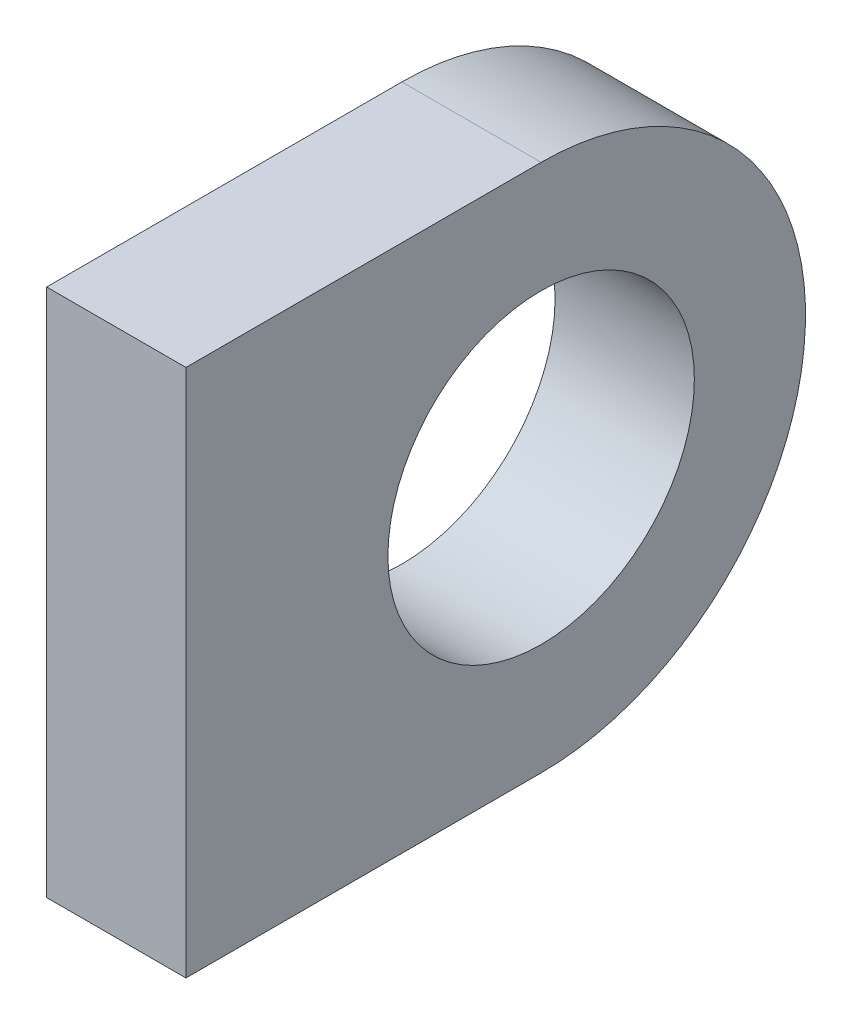
ISO-10303-21;
HEADER;
FILE_DESCRIPTION(('STEP AP214'),'2;1');
FILE_NAME('part.step','',(''),(''),'','','');
FILE_SCHEMA(('AUTOMOTIVE_DESIGN { 1 0 10303 214 1 1 1 1 }'));
ENDSEC;
DATA;
#1=APPLICATION_CONTEXT('core data for automotive mechanical design processes');
#2=APPLICATION_PROTOCOL_DEFINITION('international standard','automotive_design',2000,#1);
#3=PRODUCT_CONTEXT('',#1,'mechanical');
#4=PRODUCT('Part','Part','',(#3));
#5=PRODUCT_RELATED_PRODUCT_CATEGORY('part','',(#4));
#6=PRODUCT_DEFINITION_FORMATION('','',#4);
#7=PRODUCT_DEFINITION_CONTEXT('part definition',#1,'design');
#8=PRODUCT_DEFINITION('design','',#6,#7);
#9=PRODUCT_DEFINITION_SHAPE('','',#8);
#10=(LENGTH_UNIT() NAMED_UNIT(*) SI_UNIT(.MILLI.,.METRE.));
#11=(NAMED_UNIT(*) PLANE_ANGLE_UNIT() SI_UNIT($,.RADIAN.));
#12=(NAMED_UNIT(*) SI_UNIT($,.STERADIAN.) SOLID_ANGLE_UNIT());
#13=UNCERTAINTY_MEASURE_WITH_UNIT(LENGTH_MEASURE(1.E-05),#10,'distance_accuracy_value','');
#14=(GEOMETRIC_REPRESENTATION_CONTEXT(3) GLOBAL_UNCERTAINTY_ASSIGNED_CONTEXT((#13)) GLOBAL_UNIT_ASSIGNED_CONTEXT((#10,
#11,#12)) REPRESENTATION_CONTEXT('',''));
#15=CARTESIAN_POINT('',(0.,0.,0.));
#16=DIRECTION('',(0.,0.,1.));
#17=DIRECTION('',(1.,0.,0.));
#18=AXIS2_PLACEMENT_3D('',#15,#16,#17);
#19=CARTESIAN_POINT('',(10.,-18.9804862522201,23.4999999998584));
#20=DIRECTION('',(0.,1.,0.));
#21=DIRECTION('',(0.,0.,1.));
#22=AXIS2_PLACEMENT_3D('',#19,#20,#21);
#23=PLANE('',#22);
#24=DIRECTION('',(0.,0.,-1.));
#25=VECTOR('',#24,1.);
#26=CARTESIAN_POINT('',(0.,-18.9804862522201,23.4999999998584));
#27=LINE('',#26,#25);
#28=CARTESIAN_POINT('',(0.,-18.9804862518546,25.499999999728));
#29=VERTEX_POINT('',#28);
#30=CARTESIAN_POINT('',(0.,-18.9804862522201,0.));
#31=VERTEX_POINT('',#30);
#32=EDGE_CURVE('E59',#29,#31,#27,.T.);
#33=ORIENTED_EDGE('',*,*,#32,.T.);
#34=DIRECTION('',(-1.,0.,0.));
#35=VECTOR('',#34,1.);
#36=CARTESIAN_POINT('',(10.,-18.9804862522201,0.));
#37=LINE('',#36,#35);
#38=CARTESIAN_POINT('',(10.,-18.9804862522201,0.));
#39=VERTEX_POINT('',#38);
#40=EDGE_CURVE('E11',#39,#31,#37,.T.);
#41=ORIENTED_EDGE('',*,*,#40,.F.);
#42=DIRECTION('',(0.,0.,-1.));
#43=VECTOR('',#42,1.);
#44=CARTESIAN_POINT('',(10.,-18.9804862522201,23.4999999998584));
#45=LINE('',#44,#43);
#46=CARTESIAN_POINT('',(10.,-18.9804862518547,25.499999999728));
#47=VERTEX_POINT('',#46);
#48=EDGE_CURVE('E81',#47,#39,#45,.T.);
#49=ORIENTED_EDGE('',*,*,#48,.F.);
#50=DIRECTION('',(-1.,0.,0.));
#51=VECTOR('',#50,1.);
#52=CARTESIAN_POINT('',(0.,-18.9804862518546,25.499999999728));
#53=LINE('',#52,#51);
#54=EDGE_CURVE('E96',#47,#29,#53,.T.);
#55=ORIENTED_EDGE('',*,*,#54,.T.);
#56=EDGE_LOOP('',(#33,#41,#49,#55));
#57=FACE_BOUND('',#56,.T.);
#58=ADVANCED_FACE('F32',(#57),#23,.F.);
#59=CARTESIAN_POINT('',(10.,0.,0.));
#60=DIRECTION('',(-1.,0.,0.));
#61=DIRECTION('',(0.,0.,1.));
#62=AXIS2_PLACEMENT_3D('',#59,#60,#61);
#63=CYLINDRICAL_SURFACE('',#62,18.9804862522201);
#64=CARTESIAN_POINT('',(0.,0.,0.));
#65=DIRECTION('',(1.,0.,0.));
#66=DIRECTION('',(0.,0.,-1.));
#67=AXIS2_PLACEMENT_3D('',#64,#65,#66);
#68=CIRCLE('',#67,18.9804862522201);
#69=CARTESIAN_POINT('',(0.,18.9804862522201,0.));
#70=VERTEX_POINT('',#69);
#71=EDGE_CURVE('E82',#31,#70,#68,.T.);
#72=ORIENTED_EDGE('',*,*,#71,.T.);
#73=DIRECTION('',(-1.,0.,0.));
#74=VECTOR('',#73,1.);
#75=CARTESIAN_POINT('',(10.,18.9804862522201,0.));
#76=LINE('',#75,#74);
#77=CARTESIAN_POINT('',(10.,18.9804862522201,0.));
#78=VERTEX_POINT('',#77);
#79=EDGE_CURVE('E40',#78,#70,#76,.T.);
#80=ORIENTED_EDGE('',*,*,#79,.F.);
#81=CARTESIAN_POINT('',(10.,0.,0.));
#82=DIRECTION('',(1.,0.,0.));
#83=DIRECTION('',(0.,0.,-1.));
#84=AXIS2_PLACEMENT_3D('',#81,#82,#83);
#85=CIRCLE('',#84,18.9804862522201);
#86=EDGE_CURVE('E48',#39,#78,#85,.T.);
#87=ORIENTED_EDGE('',*,*,#86,.F.);
#88=ORIENTED_EDGE('',*,*,#40,.T.);
#89=EDGE_LOOP('',(#72,#80,#87,#88));
#90=FACE_BOUND('',#89,.T.);
#91=ADVANCED_FACE('F111',(#90),#63,.T.);
#92=CARTESIAN_POINT('',(10.,18.9804862522201,23.4999999998584));
#93=DIRECTION('',(0.,-1.,0.));
#94=DIRECTION('',(0.,0.,-1.));
#95=AXIS2_PLACEMENT_3D('',#92,#93,#94);
#96=PLANE('',#95);
#97=DIRECTION('',(0.,0.,1.));
#98=VECTOR('',#97,1.);
#99=CARTESIAN_POINT('',(0.,18.9804862522201,23.4999999998584));
#100=LINE('',#99,#98);
#101=CARTESIAN_POINT('',(0.,18.9804862522201,25.499999999728));
#102=VERTEX_POINT('',#101);
#103=EDGE_CURVE('E76',#70,#102,#100,.T.);
#104=ORIENTED_EDGE('',*,*,#103,.T.);
#105=DIRECTION('',(1.,0.,0.));
#106=VECTOR('',#105,1.);
#107=CARTESIAN_POINT('',(0.,18.9804862522201,25.499999999728));
#108=LINE('',#107,#106);
#109=CARTESIAN_POINT('',(10.,18.9804862522201,25.499999999728));
#110=VERTEX_POINT('',#109);
#111=EDGE_CURVE('E80',#102,#110,#108,.T.);
#112=ORIENTED_EDGE('',*,*,#111,.T.);
#113=DIRECTION('',(0.,0.,1.));
#114=VECTOR('',#113,1.);
#115=CARTESIAN_POINT('',(10.,18.9804862522201,23.4999999998584));
#116=LINE('',#115,#114);
#117=EDGE_CURVE('E107',#78,#110,#116,.T.);
#118=ORIENTED_EDGE('',*,*,#117,.F.);
#119=ORIENTED_EDGE('',*,*,#79,.T.);
#120=EDGE_LOOP('',(#104,#112,#118,#119));
#121=FACE_BOUND('',#120,.T.);
#122=ADVANCED_FACE('F77',(#121),#96,.F.);
#123=CARTESIAN_POINT('',(10.,0.,0.));
#124=DIRECTION('',(1.,0.,0.));
#125=DIRECTION('',(0.,0.,-1.));
#126=AXIS2_PLACEMENT_3D('',#123,#124,#125);
#127=PLANE('',#126);
#128=CARTESIAN_POINT('',(10.,0.,0.));
#129=DIRECTION('',(-1.,0.,0.));
#130=DIRECTION('',(0.,0.,1.));
#131=AXIS2_PLACEMENT_3D('',#128,#129,#130);
#132=CIRCLE('',#131,11.);
#133=CARTESIAN_POINT('',(10.,0.,11.));
#134=VERTEX_POINT('',#133);
#135=EDGE_CURVE('E100',#134,#134,#132,.T.);
#136=ORIENTED_EDGE('',*,*,#135,.T.);
#137=EDGE_LOOP('',(#136));
#138=FACE_BOUND('',#137,.T.);
#139=ORIENTED_EDGE('',*,*,#117,.T.);
#140=DIRECTION('',(0.,1.,0.));
#141=VECTOR('',#140,1.);
#142=CARTESIAN_POINT('',(10.,-29.178525279029,25.499999999728));
#143=LINE('',#142,#141);
#144=EDGE_CURVE('E89',#47,#110,#143,.T.);
#145=ORIENTED_EDGE('',*,*,#144,.F.);
#146=ORIENTED_EDGE('',*,*,#48,.T.);
#147=ORIENTED_EDGE('',*,*,#86,.T.);
#148=EDGE_LOOP('',(#139,#145,#146,#147));
#149=FACE_BOUND('',#148,.T.);
#150=ADVANCED_FACE('F112',(#138,#149),#127,.T.);
#151=CARTESIAN_POINT('',(0.,0.,0.));
#152=DIRECTION('',(1.,0.,0.));
#153=DIRECTION('',(0.,0.,-1.));
#154=AXIS2_PLACEMENT_3D('',#151,#152,#153);
#155=PLANE('',#154);
#156=CARTESIAN_POINT('',(0.,0.,0.));
#157=DIRECTION('',(-1.,0.,0.));
#158=DIRECTION('',(0.,0.,1.));
#159=AXIS2_PLACEMENT_3D('',#156,#157,#158);
#160=CIRCLE('',#159,11.);
#161=CARTESIAN_POINT('',(0.,0.,11.));
#162=VERTEX_POINT('',#161);
#163=EDGE_CURVE('E99',#162,#162,#160,.T.);
#164=ORIENTED_EDGE('',*,*,#163,.F.);
#165=EDGE_LOOP('',(#164));
#166=FACE_BOUND('',#165,.T.);
#167=ORIENTED_EDGE('',*,*,#32,.F.);
#168=DIRECTION('',(0.,1.,0.));
#169=VECTOR('',#168,1.);
#170=CARTESIAN_POINT('',(0.,-29.178525279029,25.499999999728));
#171=LINE('',#170,#169);
#172=EDGE_CURVE('E85',#29,#102,#171,.T.);
#173=ORIENTED_EDGE('',*,*,#172,.T.);
#174=ORIENTED_EDGE('',*,*,#103,.F.);
#175=ORIENTED_EDGE('',*,*,#71,.F.);
#176=EDGE_LOOP('',(#167,#173,#174,#175));
#177=FACE_BOUND('',#176,.T.);
#178=ADVANCED_FACE('F86',(#166,#177),#155,.F.);
#179=CARTESIAN_POINT('',(10.,0.,0.));
#180=DIRECTION('',(-1.,0.,0.));
#181=DIRECTION('',(0.,0.,1.));
#182=AXIS2_PLACEMENT_3D('',#179,#180,#181);
#183=CYLINDRICAL_SURFACE('',#182,11.);
#184=ORIENTED_EDGE('',*,*,#135,.F.);
#185=EDGE_LOOP('',(#184));
#186=FACE_BOUND('',#185,.T.);
#187=ORIENTED_EDGE('',*,*,#163,.T.);
#188=EDGE_LOOP('',(#187));
#189=FACE_BOUND('',#188,.T.);
#190=ADVANCED_FACE('F120',(#186,#189),#183,.F.);
#191=CARTESIAN_POINT('',(0.,-29.178525279029,25.499999999728));
#192=DIRECTION('',(0.,0.,1.));
#193=DIRECTION('',(1.,0.,0.));
#194=AXIS2_PLACEMENT_3D('',#191,#192,#193);
#195=PLANE('',#194);
#196=ORIENTED_EDGE('',*,*,#54,.F.);
#197=ORIENTED_EDGE('',*,*,#144,.T.);
#198=ORIENTED_EDGE('',*,*,#111,.F.);
#199=ORIENTED_EDGE('',*,*,#172,.F.);
#200=EDGE_LOOP('',(#196,#197,#198,#199));
#201=FACE_BOUND('',#200,.T.);
#202=ADVANCED_FACE('F92',(#201),#195,.T.);
#203=CLOSED_SHELL('',(#58,#91,#122,#150,#178,#190,#202));
#204=MANIFOLD_SOLID_BREP('B2',#203);
#205=ADVANCED_BREP_SHAPE_REPRESENTATION('',(#18,#204),#14);
#206=SHAPE_DEFINITION_REPRESENTATION(#9,#205);
ENDSEC;
END-ISO-10303-21;
